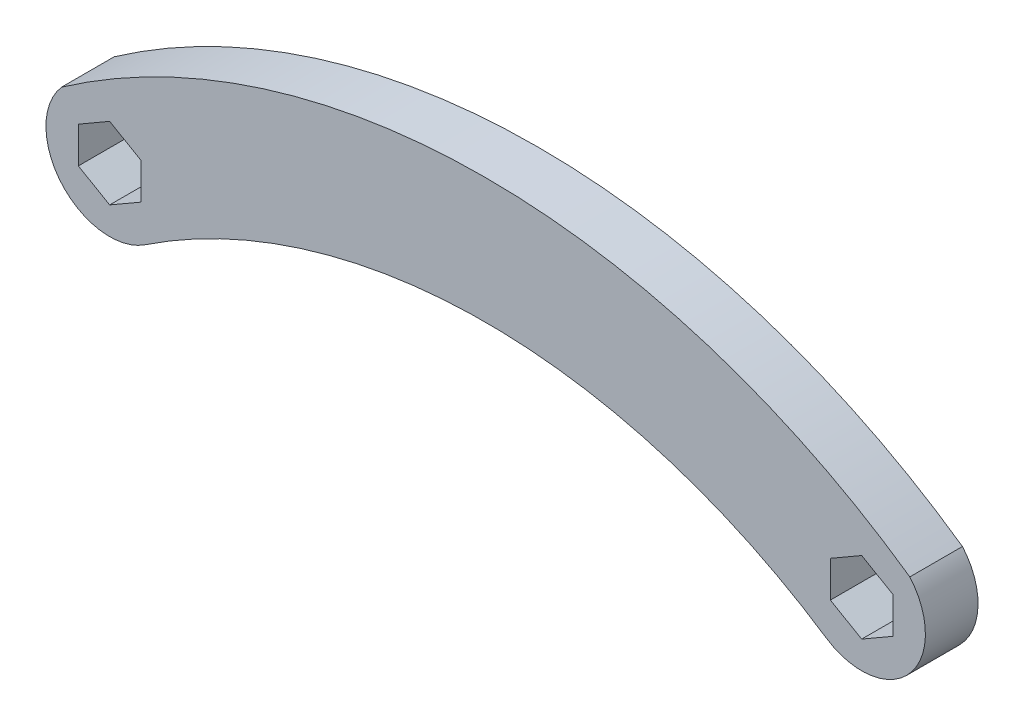
ISO-10303-21;
HEADER;
FILE_DESCRIPTION(('STEP AP214'),'2;1');
FILE_NAME('part.step','',(''),(''),'','','');
FILE_SCHEMA(('AUTOMOTIVE_DESIGN { 1 0 10303 214 1 1 1 1 }'));
ENDSEC;
DATA;
#1=APPLICATION_CONTEXT('core data for automotive mechanical design processes');
#2=APPLICATION_PROTOCOL_DEFINITION('international standard','automotive_design',2000,#1);
#3=PRODUCT_CONTEXT('',#1,'mechanical');
#4=PRODUCT('Part','Part','',(#3));
#5=PRODUCT_RELATED_PRODUCT_CATEGORY('part','',(#4));
#6=PRODUCT_DEFINITION_FORMATION('','',#4);
#7=PRODUCT_DEFINITION_CONTEXT('part definition',#1,'design');
#8=PRODUCT_DEFINITION('design','',#6,#7);
#9=PRODUCT_DEFINITION_SHAPE('','',#8);
#10=(LENGTH_UNIT() NAMED_UNIT(*) SI_UNIT(.MILLI.,.METRE.));
#11=(NAMED_UNIT(*) PLANE_ANGLE_UNIT() SI_UNIT($,.RADIAN.));
#12=(NAMED_UNIT(*) SI_UNIT($,.STERADIAN.) SOLID_ANGLE_UNIT());
#13=UNCERTAINTY_MEASURE_WITH_UNIT(LENGTH_MEASURE(1.E-05),#10,'distance_accuracy_value','');
#14=(GEOMETRIC_REPRESENTATION_CONTEXT(3) GLOBAL_UNCERTAINTY_ASSIGNED_CONTEXT((#13)) GLOBAL_UNIT_ASSIGNED_CONTEXT((#10,
#11,#12)) REPRESENTATION_CONTEXT('',''));
#15=CARTESIAN_POINT('',(0.,0.,0.));
#16=DIRECTION('',(0.,0.,1.));
#17=DIRECTION('',(1.,0.,0.));
#18=AXIS2_PLACEMENT_3D('',#15,#16,#17);
#19=CARTESIAN_POINT('',(-19.05,28.575,5.334));
#20=DIRECTION('',(0.,0.,1.));
#21=DIRECTION('',(1.,0.,0.));
#22=AXIS2_PLACEMENT_3D('',#19,#20,#21);
#23=PLANE('',#22);
#24=CARTESIAN_POINT('',(-38.1,57.15,5.334));
#25=DIRECTION('',(0.,0.,1.));
#26=DIRECTION('',(1.,0.,0.));
#27=AXIS2_PLACEMENT_3D('',#24,#25,#26);
#28=CIRCLE('',#27,6.45575179758904);
#29=CARTESIAN_POINT('',(-42.977057525789,61.3797802735153,5.334));
#30=VERTEX_POINT('',#29);
#31=CARTESIAN_POINT('',(-34.518993211096,51.778489816644,5.334));
#32=VERTEX_POINT('',#31);
#33=EDGE_CURVE('E241',#30,#32,#28,.T.);
#34=ORIENTED_EDGE('',*,*,#33,.T.);
#35=CARTESIAN_POINT('',(0.,0.,5.334));
#36=DIRECTION('',(0.,0.,-1.));
#37=DIRECTION('',(1.,0.,0.));
#38=AXIS2_PLACEMENT_3D('',#35,#36,#37);
#39=CIRCLE('',#38,62.23);
#40=CARTESIAN_POINT('',(34.518993211096,51.778489816644,5.334));
#41=VERTEX_POINT('',#40);
#42=EDGE_CURVE('E244',#32,#41,#39,.T.);
#43=ORIENTED_EDGE('',*,*,#42,.T.);
#44=CARTESIAN_POINT('',(38.1,57.15,5.334));
#45=DIRECTION('',(0.,0.,1.));
#46=DIRECTION('',(-1.,0.,0.));
#47=AXIS2_PLACEMENT_3D('',#44,#45,#46);
#48=CIRCLE('',#47,6.45575179758904);
#49=CARTESIAN_POINT('',(42.977057525789,61.3797802735153,5.334));
#50=VERTEX_POINT('',#49);
#51=EDGE_CURVE('E247',#41,#50,#48,.T.);
#52=ORIENTED_EDGE('',*,*,#51,.T.);
#53=CARTESIAN_POINT('',(0.,0.,5.334));
#54=DIRECTION('',(0.,0.,1.));
#55=DIRECTION('',(1.,0.,0.));
#56=AXIS2_PLACEMENT_3D('',#53,#54,#55);
#57=CIRCLE('',#56,74.93);
#58=EDGE_CURVE('E249',#50,#30,#57,.T.);
#59=ORIENTED_EDGE('',*,*,#58,.T.);
#60=EDGE_LOOP('',(#34,#43,#52,#59));
#61=FACE_BOUND('',#60,.T.);
#62=DIRECTION('',(-0.866025403784438,-0.500000000000001,0.));
#63=VECTOR('',#62,1.);
#64=CARTESIAN_POINT('',(-38.1,60.8161742093541,5.334));
#65=LINE('',#64,#63);
#66=CARTESIAN_POINT('',(-38.1,60.8161742093541,5.334));
#67=VERTEX_POINT('',#66);
#68=CARTESIAN_POINT('',(-41.275,58.9830871046771,5.334));
#69=VERTEX_POINT('',#68);
#70=EDGE_CURVE('E198',#67,#69,#65,.T.);
#71=ORIENTED_EDGE('',*,*,#70,.F.);
#72=DIRECTION('',(-0.866025403784438,0.500000000000001,0.));
#73=VECTOR('',#72,1.);
#74=CARTESIAN_POINT('',(-34.925,58.9830871046771,5.334));
#75=LINE('',#74,#73);
#76=CARTESIAN_POINT('',(-34.925,58.9830871046771,5.334));
#77=VERTEX_POINT('',#76);
#78=EDGE_CURVE('E196',#77,#67,#75,.T.);
#79=ORIENTED_EDGE('',*,*,#78,.F.);
#80=DIRECTION('',(0.,1.,0.));
#81=VECTOR('',#80,1.);
#82=CARTESIAN_POINT('',(-34.925,55.3169128953229,5.334));
#83=LINE('',#82,#81);
#84=CARTESIAN_POINT('',(-34.925,55.3169128953229,5.334));
#85=VERTEX_POINT('',#84);
#86=EDGE_CURVE('E208',#85,#77,#83,.T.);
#87=ORIENTED_EDGE('',*,*,#86,.F.);
#88=DIRECTION('',(0.866025403784438,0.500000000000001,0.));
#89=VECTOR('',#88,1.);
#90=CARTESIAN_POINT('',(-38.1,53.4838257906459,5.334));
#91=LINE('',#90,#89);
#92=CARTESIAN_POINT('',(-38.1,53.4838257906459,5.334));
#93=VERTEX_POINT('',#92);
#94=EDGE_CURVE('E205',#93,#85,#91,.T.);
#95=ORIENTED_EDGE('',*,*,#94,.F.);
#96=DIRECTION('',(0.866025403784438,-0.500000000000001,0.));
#97=VECTOR('',#96,1.);
#98=CARTESIAN_POINT('',(-41.275,55.3169128953229,5.334));
#99=LINE('',#98,#97);
#100=CARTESIAN_POINT('',(-41.275,55.3169128953229,5.334));
#101=VERTEX_POINT('',#100);
#102=EDGE_CURVE('E203',#101,#93,#99,.T.);
#103=ORIENTED_EDGE('',*,*,#102,.F.);
#104=DIRECTION('',(0.,-1.,0.));
#105=VECTOR('',#104,1.);
#106=CARTESIAN_POINT('',(-41.275,58.9830871046771,5.334));
#107=LINE('',#106,#105);
#108=EDGE_CURVE('E201',#69,#101,#107,.T.);
#109=ORIENTED_EDGE('',*,*,#108,.F.);
#110=EDGE_LOOP('',(#71,#79,#87,#95,#103,#109));
#111=FACE_BOUND('',#110,.T.);
#112=DIRECTION('',(-0.866025403784438,-0.5,0.));
#113=VECTOR('',#112,1.);
#114=CARTESIAN_POINT('',(38.1,60.8161742093541,5.334));
#115=LINE('',#114,#113);
#116=CARTESIAN_POINT('',(38.1,60.8161742093541,5.334));
#117=VERTEX_POINT('',#116);
#118=CARTESIAN_POINT('',(34.925,58.9830871046771,5.334));
#119=VERTEX_POINT('',#118);
#120=EDGE_CURVE('E153',#117,#119,#115,.T.);
#121=ORIENTED_EDGE('',*,*,#120,.F.);
#122=DIRECTION('',(-0.866025403784438,0.5,0.));
#123=VECTOR('',#122,1.);
#124=CARTESIAN_POINT('',(41.275,58.9830871046771,5.334));
#125=LINE('',#124,#123);
#126=CARTESIAN_POINT('',(41.275,58.9830871046771,5.334));
#127=VERTEX_POINT('',#126);
#128=EDGE_CURVE('E145',#127,#117,#125,.T.);
#129=ORIENTED_EDGE('',*,*,#128,.F.);
#130=DIRECTION('',(0.,1.,0.));
#131=VECTOR('',#130,1.);
#132=CARTESIAN_POINT('',(41.275,55.316912895323,5.334));
#133=LINE('',#132,#131);
#134=CARTESIAN_POINT('',(41.275,55.316912895323,5.334));
#135=VERTEX_POINT('',#134);
#136=EDGE_CURVE('E174',#135,#127,#133,.T.);
#137=ORIENTED_EDGE('',*,*,#136,.F.);
#138=DIRECTION('',(0.866025403784438,0.5,0.));
#139=VECTOR('',#138,1.);
#140=CARTESIAN_POINT('',(38.1,53.4838257906459,5.334));
#141=LINE('',#140,#139);
#142=CARTESIAN_POINT('',(38.1,53.4838257906459,5.334));
#143=VERTEX_POINT('',#142);
#144=EDGE_CURVE('E172',#143,#135,#141,.T.);
#145=ORIENTED_EDGE('',*,*,#144,.F.);
#146=DIRECTION('',(0.866025403784439,-0.499999999999999,0.));
#147=VECTOR('',#146,1.);
#148=CARTESIAN_POINT('',(34.925,55.3169128953229,5.334));
#149=LINE('',#148,#147);
#150=CARTESIAN_POINT('',(34.925,55.3169128953229,5.334));
#151=VERTEX_POINT('',#150);
#152=EDGE_CURVE('E168',#151,#143,#149,.T.);
#153=ORIENTED_EDGE('',*,*,#152,.F.);
#154=DIRECTION('',(0.,-1.,0.));
#155=VECTOR('',#154,1.);
#156=CARTESIAN_POINT('',(34.925,58.9830871046771,5.334));
#157=LINE('',#156,#155);
#158=EDGE_CURVE('E166',#119,#151,#157,.T.);
#159=ORIENTED_EDGE('',*,*,#158,.F.);
#160=EDGE_LOOP('',(#121,#129,#137,#145,#153,#159));
#161=FACE_BOUND('',#160,.T.);
#162=ADVANCED_FACE('F32',(#61,#111,#161),#23,.T.);
#163=CARTESIAN_POINT('',(-19.05,28.575,0.));
#164=DIRECTION('',(0.,0.,1.));
#165=DIRECTION('',(1.,0.,0.));
#166=AXIS2_PLACEMENT_3D('',#163,#164,#165);
#167=PLANE('',#166);
#168=DIRECTION('',(-0.866025403784438,0.500000000000001,0.));
#169=VECTOR('',#168,1.);
#170=CARTESIAN_POINT('',(-34.925,58.9830871046771,0.));
#171=LINE('',#170,#169);
#172=CARTESIAN_POINT('',(-34.925,58.9830871046771,0.));
#173=VERTEX_POINT('',#172);
#174=CARTESIAN_POINT('',(-38.1,60.8161742093541,0.));
#175=VERTEX_POINT('',#174);
#176=EDGE_CURVE('E161',#173,#175,#171,.T.);
#177=ORIENTED_EDGE('',*,*,#176,.T.);
#178=DIRECTION('',(-0.866025403784438,-0.500000000000001,0.));
#179=VECTOR('',#178,1.);
#180=CARTESIAN_POINT('',(-38.1,60.8161742093541,0.));
#181=LINE('',#180,#179);
#182=CARTESIAN_POINT('',(-41.275,58.9830871046771,0.));
#183=VERTEX_POINT('',#182);
#184=EDGE_CURVE('E213',#175,#183,#181,.T.);
#185=ORIENTED_EDGE('',*,*,#184,.T.);
#186=DIRECTION('',(0.,-1.,0.));
#187=VECTOR('',#186,1.);
#188=CARTESIAN_POINT('',(-41.275,58.9830871046771,0.));
#189=LINE('',#188,#187);
#190=CARTESIAN_POINT('',(-41.275,55.3169128953229,0.));
#191=VERTEX_POINT('',#190);
#192=EDGE_CURVE('E216',#183,#191,#189,.T.);
#193=ORIENTED_EDGE('',*,*,#192,.T.);
#194=DIRECTION('',(0.866025403784438,-0.500000000000001,0.));
#195=VECTOR('',#194,1.);
#196=CARTESIAN_POINT('',(-41.275,55.3169128953229,0.));
#197=LINE('',#196,#195);
#198=CARTESIAN_POINT('',(-38.1,53.4838257906459,0.));
#199=VERTEX_POINT('',#198);
#200=EDGE_CURVE('E219',#191,#199,#197,.T.);
#201=ORIENTED_EDGE('',*,*,#200,.T.);
#202=DIRECTION('',(0.866025403784438,0.500000000000001,0.));
#203=VECTOR('',#202,1.);
#204=CARTESIAN_POINT('',(-38.1,53.4838257906459,0.));
#205=LINE('',#204,#203);
#206=CARTESIAN_POINT('',(-34.925,55.3169128953229,0.));
#207=VERTEX_POINT('',#206);
#208=EDGE_CURVE('E222',#199,#207,#205,.T.);
#209=ORIENTED_EDGE('',*,*,#208,.T.);
#210=DIRECTION('',(0.,1.,0.));
#211=VECTOR('',#210,1.);
#212=CARTESIAN_POINT('',(-34.925,55.3169128953229,0.));
#213=LINE('',#212,#211);
#214=EDGE_CURVE('E199',#207,#173,#213,.T.);
#215=ORIENTED_EDGE('',*,*,#214,.T.);
#216=EDGE_LOOP('',(#177,#185,#193,#201,#209,#215));
#217=FACE_BOUND('',#216,.T.);
#218=CARTESIAN_POINT('',(-38.1,57.15,0.));
#219=DIRECTION('',(0.,0.,1.));
#220=DIRECTION('',(1.,0.,0.));
#221=AXIS2_PLACEMENT_3D('',#218,#219,#220);
#222=CIRCLE('',#221,6.45575179758904);
#223=CARTESIAN_POINT('',(-42.977057525789,61.3797802735153,0.));
#224=VERTEX_POINT('',#223);
#225=CARTESIAN_POINT('',(-34.518993211096,51.778489816644,0.));
#226=VERTEX_POINT('',#225);
#227=EDGE_CURVE('E240',#224,#226,#222,.T.);
#228=ORIENTED_EDGE('',*,*,#227,.F.);
#229=CARTESIAN_POINT('',(0.,0.,0.));
#230=DIRECTION('',(0.,0.,1.));
#231=DIRECTION('',(1.,0.,0.));
#232=AXIS2_PLACEMENT_3D('',#229,#230,#231);
#233=CIRCLE('',#232,74.93);
#234=CARTESIAN_POINT('',(42.977057525789,61.3797802735153,0.));
#235=VERTEX_POINT('',#234);
#236=EDGE_CURVE('E245',#235,#224,#233,.T.);
#237=ORIENTED_EDGE('',*,*,#236,.F.);
#238=CARTESIAN_POINT('',(38.1,57.15,0.));
#239=DIRECTION('',(0.,0.,1.));
#240=DIRECTION('',(-1.,0.,0.));
#241=AXIS2_PLACEMENT_3D('',#238,#239,#240);
#242=CIRCLE('',#241,6.45575179758904);
#243=CARTESIAN_POINT('',(34.518993211096,51.778489816644,0.));
#244=VERTEX_POINT('',#243);
#245=EDGE_CURVE('E256',#244,#235,#242,.T.);
#246=ORIENTED_EDGE('',*,*,#245,.F.);
#247=CARTESIAN_POINT('',(0.,0.,0.));
#248=DIRECTION('',(0.,0.,-1.));
#249=DIRECTION('',(1.,0.,0.));
#250=AXIS2_PLACEMENT_3D('',#247,#248,#249);
#251=CIRCLE('',#250,62.23);
#252=EDGE_CURVE('E254',#226,#244,#251,.T.);
#253=ORIENTED_EDGE('',*,*,#252,.F.);
#254=EDGE_LOOP('',(#228,#237,#246,#253));
#255=FACE_BOUND('',#254,.T.);
#256=DIRECTION('',(-0.866025403784438,0.5,0.));
#257=VECTOR('',#256,1.);
#258=CARTESIAN_POINT('',(41.275,58.9830871046771,0.));
#259=LINE('',#258,#257);
#260=CARTESIAN_POINT('',(41.275,58.9830871046771,0.));
#261=VERTEX_POINT('',#260);
#262=CARTESIAN_POINT('',(38.1,60.8161742093541,0.));
#263=VERTEX_POINT('',#262);
#264=EDGE_CURVE('E55',#261,#263,#259,.T.);
#265=ORIENTED_EDGE('',*,*,#264,.T.);
#266=DIRECTION('',(-0.866025403784438,-0.5,0.));
#267=VECTOR('',#266,1.);
#268=CARTESIAN_POINT('',(38.1,60.8161742093541,0.));
#269=LINE('',#268,#267);
#270=CARTESIAN_POINT('',(34.925,58.9830871046771,0.));
#271=VERTEX_POINT('',#270);
#272=EDGE_CURVE('E160',#263,#271,#269,.T.);
#273=ORIENTED_EDGE('',*,*,#272,.T.);
#274=DIRECTION('',(0.,-1.,0.));
#275=VECTOR('',#274,1.);
#276=CARTESIAN_POINT('',(34.925,58.9830871046771,0.));
#277=LINE('',#276,#275);
#278=CARTESIAN_POINT('',(34.925,55.3169128953229,0.));
#279=VERTEX_POINT('',#278);
#280=EDGE_CURVE('E178',#271,#279,#277,.T.);
#281=ORIENTED_EDGE('',*,*,#280,.T.);
#282=DIRECTION('',(0.866025403784439,-0.499999999999999,0.));
#283=VECTOR('',#282,1.);
#284=CARTESIAN_POINT('',(34.925,55.3169128953229,0.));
#285=LINE('',#284,#283);
#286=CARTESIAN_POINT('',(38.1,53.4838257906459,0.));
#287=VERTEX_POINT('',#286);
#288=EDGE_CURVE('E181',#279,#287,#285,.T.);
#289=ORIENTED_EDGE('',*,*,#288,.T.);
#290=DIRECTION('',(0.866025403784438,0.5,0.));
#291=VECTOR('',#290,1.);
#292=CARTESIAN_POINT('',(38.1,53.4838257906459,0.));
#293=LINE('',#292,#291);
#294=CARTESIAN_POINT('',(41.275,55.316912895323,0.));
#295=VERTEX_POINT('',#294);
#296=EDGE_CURVE('E184',#287,#295,#293,.T.);
#297=ORIENTED_EDGE('',*,*,#296,.T.);
#298=DIRECTION('',(0.,1.,0.));
#299=VECTOR('',#298,1.);
#300=CARTESIAN_POINT('',(41.275,55.316912895323,0.));
#301=LINE('',#300,#299);
#302=EDGE_CURVE('E154',#295,#261,#301,.T.);
#303=ORIENTED_EDGE('',*,*,#302,.T.);
#304=EDGE_LOOP('',(#265,#273,#281,#289,#297,#303));
#305=FACE_BOUND('',#304,.T.);
#306=ADVANCED_FACE('F274',(#217,#255,#305),#167,.F.);
#307=CARTESIAN_POINT('',(-38.1,57.15,5.334));
#308=DIRECTION('',(0.,0.,-1.));
#309=DIRECTION('',(-1.,0.,0.));
#310=AXIS2_PLACEMENT_3D('',#307,#308,#309);
#311=CYLINDRICAL_SURFACE('',#310,6.45575179758904);
#312=ORIENTED_EDGE('',*,*,#227,.T.);
#313=DIRECTION('',(0.,0.,-1.));
#314=VECTOR('',#313,1.);
#315=CARTESIAN_POINT('',(-34.518993211096,51.778489816644,5.334));
#316=LINE('',#315,#314);
#317=EDGE_CURVE('E11',#32,#226,#316,.T.);
#318=ORIENTED_EDGE('',*,*,#317,.F.);
#319=ORIENTED_EDGE('',*,*,#33,.F.);
#320=DIRECTION('',(0.,0.,-1.));
#321=VECTOR('',#320,1.);
#322=CARTESIAN_POINT('',(-42.977057525789,61.3797802735153,5.334));
#323=LINE('',#322,#321);
#324=EDGE_CURVE('E251',#30,#224,#323,.T.);
#325=ORIENTED_EDGE('',*,*,#324,.T.);
#326=EDGE_LOOP('',(#312,#318,#319,#325));
#327=FACE_BOUND('',#326,.T.);
#328=ADVANCED_FACE('F34',(#327),#311,.T.);
#329=CARTESIAN_POINT('',(0.,0.,5.334));
#330=DIRECTION('',(0.,0.,-1.));
#331=DIRECTION('',(-1.,0.,0.));
#332=AXIS2_PLACEMENT_3D('',#329,#330,#331);
#333=CYLINDRICAL_SURFACE('',#332,62.23);
#334=ORIENTED_EDGE('',*,*,#252,.T.);
#335=DIRECTION('',(0.,0.,-1.));
#336=VECTOR('',#335,1.);
#337=CARTESIAN_POINT('',(34.518993211096,51.778489816644,5.334));
#338=LINE('',#337,#336);
#339=EDGE_CURVE('E40',#41,#244,#338,.T.);
#340=ORIENTED_EDGE('',*,*,#339,.F.);
#341=ORIENTED_EDGE('',*,*,#42,.F.);
#342=ORIENTED_EDGE('',*,*,#317,.T.);
#343=EDGE_LOOP('',(#334,#340,#341,#342));
#344=FACE_BOUND('',#343,.T.);
#345=ADVANCED_FACE('F285',(#344),#333,.F.);
#346=CARTESIAN_POINT('',(38.1,57.15,5.334));
#347=DIRECTION('',(0.,0.,-1.));
#348=DIRECTION('',(-1.,0.,0.));
#349=AXIS2_PLACEMENT_3D('',#346,#347,#348);
#350=CYLINDRICAL_SURFACE('',#349,6.45575179758904);
#351=ORIENTED_EDGE('',*,*,#245,.T.);
#352=DIRECTION('',(0.,0.,-1.));
#353=VECTOR('',#352,1.);
#354=CARTESIAN_POINT('',(42.977057525789,61.3797802735153,5.334));
#355=LINE('',#354,#353);
#356=EDGE_CURVE('E261',#50,#235,#355,.T.);
#357=ORIENTED_EDGE('',*,*,#356,.F.);
#358=ORIENTED_EDGE('',*,*,#51,.F.);
#359=ORIENTED_EDGE('',*,*,#339,.T.);
#360=EDGE_LOOP('',(#351,#357,#358,#359));
#361=FACE_BOUND('',#360,.T.);
#362=ADVANCED_FACE('F268',(#361),#350,.T.);
#363=CARTESIAN_POINT('',(0.,0.,5.334));
#364=DIRECTION('',(0.,0.,-1.));
#365=DIRECTION('',(-1.,0.,0.));
#366=AXIS2_PLACEMENT_3D('',#363,#364,#365);
#367=CYLINDRICAL_SURFACE('',#366,74.93);
#368=ORIENTED_EDGE('',*,*,#236,.T.);
#369=ORIENTED_EDGE('',*,*,#324,.F.);
#370=ORIENTED_EDGE('',*,*,#58,.F.);
#371=ORIENTED_EDGE('',*,*,#356,.T.);
#372=EDGE_LOOP('',(#368,#369,#370,#371));
#373=FACE_BOUND('',#372,.T.);
#374=ADVANCED_FACE('F278',(#373),#367,.T.);
#375=CARTESIAN_POINT('',(-34.925,58.9830871046771,5.334));
#376=DIRECTION('',(-0.500000000000001,-0.866025403784438,0.));
#377=DIRECTION('',(0.866025403784438,-0.500000000000001,0.));
#378=AXIS2_PLACEMENT_3D('',#375,#376,#377);
#379=PLANE('',#378);
#380=ORIENTED_EDGE('',*,*,#176,.F.);
#381=DIRECTION('',(0.,0.,-1.));
#382=VECTOR('',#381,1.);
#383=CARTESIAN_POINT('',(-34.925,58.9830871046771,5.334));
#384=LINE('',#383,#382);
#385=EDGE_CURVE('E210',#77,#173,#384,.T.);
#386=ORIENTED_EDGE('',*,*,#385,.F.);
#387=ORIENTED_EDGE('',*,*,#78,.T.);
#388=DIRECTION('',(0.,0.,-1.));
#389=VECTOR('',#388,1.);
#390=CARTESIAN_POINT('',(-38.1,60.8161742093541,5.334));
#391=LINE('',#390,#389);
#392=EDGE_CURVE('E237',#67,#175,#391,.T.);
#393=ORIENTED_EDGE('',*,*,#392,.T.);
#394=EDGE_LOOP('',(#380,#386,#387,#393));
#395=FACE_BOUND('',#394,.T.);
#396=ADVANCED_FACE('F300',(#395),#379,.T.);
#397=CARTESIAN_POINT('',(-38.1,60.8161742093541,5.334));
#398=DIRECTION('',(0.500000000000001,-0.866025403784438,0.));
#399=DIRECTION('',(0.866025403784438,0.500000000000001,0.));
#400=AXIS2_PLACEMENT_3D('',#397,#398,#399);
#401=PLANE('',#400);
#402=ORIENTED_EDGE('',*,*,#184,.F.);
#403=ORIENTED_EDGE('',*,*,#392,.F.);
#404=ORIENTED_EDGE('',*,*,#70,.T.);
#405=DIRECTION('',(0.,0.,-1.));
#406=VECTOR('',#405,1.);
#407=CARTESIAN_POINT('',(-41.275,58.9830871046771,5.334));
#408=LINE('',#407,#406);
#409=EDGE_CURVE('E235',#69,#183,#408,.T.);
#410=ORIENTED_EDGE('',*,*,#409,.T.);
#411=EDGE_LOOP('',(#402,#403,#404,#410));
#412=FACE_BOUND('',#411,.T.);
#413=ADVANCED_FACE('F307',(#412),#401,.T.);
#414=CARTESIAN_POINT('',(-41.275,58.9830871046771,5.334));
#415=DIRECTION('',(1.,0.,0.));
#416=DIRECTION('',(0.,0.,-1.));
#417=AXIS2_PLACEMENT_3D('',#414,#415,#416);
#418=PLANE('',#417);
#419=ORIENTED_EDGE('',*,*,#192,.F.);
#420=ORIENTED_EDGE('',*,*,#409,.F.);
#421=ORIENTED_EDGE('',*,*,#108,.T.);
#422=DIRECTION('',(0.,0.,-1.));
#423=VECTOR('',#422,1.);
#424=CARTESIAN_POINT('',(-41.275,55.3169128953229,5.334));
#425=LINE('',#424,#423);
#426=EDGE_CURVE('E233',#101,#191,#425,.T.);
#427=ORIENTED_EDGE('',*,*,#426,.T.);
#428=EDGE_LOOP('',(#419,#420,#421,#427));
#429=FACE_BOUND('',#428,.T.);
#430=ADVANCED_FACE('F312',(#429),#418,.T.);
#431=CARTESIAN_POINT('',(-41.275,55.3169128953229,5.334));
#432=DIRECTION('',(0.500000000000001,0.866025403784438,0.));
#433=DIRECTION('',(-0.866025403784438,0.500000000000001,0.));
#434=AXIS2_PLACEMENT_3D('',#431,#432,#433);
#435=PLANE('',#434);
#436=ORIENTED_EDGE('',*,*,#200,.F.);
#437=ORIENTED_EDGE('',*,*,#426,.F.);
#438=ORIENTED_EDGE('',*,*,#102,.T.);
#439=DIRECTION('',(0.,0.,-1.));
#440=VECTOR('',#439,1.);
#441=CARTESIAN_POINT('',(-38.1,53.4838257906459,5.334));
#442=LINE('',#441,#440);
#443=EDGE_CURVE('E231',#93,#199,#442,.T.);
#444=ORIENTED_EDGE('',*,*,#443,.T.);
#445=EDGE_LOOP('',(#436,#437,#438,#444));
#446=FACE_BOUND('',#445,.T.);
#447=ADVANCED_FACE('F335',(#446),#435,.T.);
#448=CARTESIAN_POINT('',(-38.1,53.4838257906459,5.334));
#449=DIRECTION('',(-0.500000000000001,0.866025403784438,0.));
#450=DIRECTION('',(-0.866025403784438,-0.500000000000001,0.));
#451=AXIS2_PLACEMENT_3D('',#448,#449,#450);
#452=PLANE('',#451);
#453=ORIENTED_EDGE('',*,*,#208,.F.);
#454=ORIENTED_EDGE('',*,*,#443,.F.);
#455=ORIENTED_EDGE('',*,*,#94,.T.);
#456=DIRECTION('',(0.,0.,-1.));
#457=VECTOR('',#456,1.);
#458=CARTESIAN_POINT('',(-34.925,55.3169128953229,5.334));
#459=LINE('',#458,#457);
#460=EDGE_CURVE('E229',#85,#207,#459,.T.);
#461=ORIENTED_EDGE('',*,*,#460,.T.);
#462=EDGE_LOOP('',(#453,#454,#455,#461));
#463=FACE_BOUND('',#462,.T.);
#464=ADVANCED_FACE('F325',(#463),#452,.T.);
#465=CARTESIAN_POINT('',(-34.925,55.3169128953229,5.334));
#466=DIRECTION('',(-1.,0.,0.));
#467=DIRECTION('',(0.,0.,1.));
#468=AXIS2_PLACEMENT_3D('',#465,#466,#467);
#469=PLANE('',#468);
#470=ORIENTED_EDGE('',*,*,#214,.F.);
#471=ORIENTED_EDGE('',*,*,#460,.F.);
#472=ORIENTED_EDGE('',*,*,#86,.T.);
#473=ORIENTED_EDGE('',*,*,#385,.T.);
#474=EDGE_LOOP('',(#470,#471,#472,#473));
#475=FACE_BOUND('',#474,.T.);
#476=ADVANCED_FACE('F319',(#475),#469,.T.);
#477=CARTESIAN_POINT('',(41.275,58.9830871046771,5.334));
#478=DIRECTION('',(-0.5,-0.866025403784438,0.));
#479=DIRECTION('',(0.866025403784439,-0.5,0.));
#480=AXIS2_PLACEMENT_3D('',#477,#478,#479);
#481=PLANE('',#480);
#482=ORIENTED_EDGE('',*,*,#264,.F.);
#483=DIRECTION('',(0.,0.,-1.));
#484=VECTOR('',#483,1.);
#485=CARTESIAN_POINT('',(41.275,58.9830871046771,5.334));
#486=LINE('',#485,#484);
#487=EDGE_CURVE('E149',#127,#261,#486,.T.);
#488=ORIENTED_EDGE('',*,*,#487,.F.);
#489=ORIENTED_EDGE('',*,*,#128,.T.);
#490=DIRECTION('',(0.,0.,-1.));
#491=VECTOR('',#490,1.);
#492=CARTESIAN_POINT('',(38.1,60.8161742093541,5.334));
#493=LINE('',#492,#491);
#494=EDGE_CURVE('E148',#117,#263,#493,.T.);
#495=ORIENTED_EDGE('',*,*,#494,.T.);
#496=EDGE_LOOP('',(#482,#488,#489,#495));
#497=FACE_BOUND('',#496,.T.);
#498=ADVANCED_FACE('F147',(#497),#481,.T.);
#499=CARTESIAN_POINT('',(38.1,60.8161742093541,5.334));
#500=DIRECTION('',(0.5,-0.866025403784438,0.));
#501=DIRECTION('',(0.866025403784439,0.5,0.));
#502=AXIS2_PLACEMENT_3D('',#499,#500,#501);
#503=PLANE('',#502);
#504=ORIENTED_EDGE('',*,*,#272,.F.);
#505=ORIENTED_EDGE('',*,*,#494,.F.);
#506=ORIENTED_EDGE('',*,*,#120,.T.);
#507=DIRECTION('',(0.,0.,-1.));
#508=VECTOR('',#507,1.);
#509=CARTESIAN_POINT('',(34.925,58.9830871046771,5.334));
#510=LINE('',#509,#508);
#511=EDGE_CURVE('E162',#119,#271,#510,.T.);
#512=ORIENTED_EDGE('',*,*,#511,.T.);
#513=EDGE_LOOP('',(#504,#505,#506,#512));
#514=FACE_BOUND('',#513,.T.);
#515=ADVANCED_FACE('F157',(#514),#503,.T.);
#516=CARTESIAN_POINT('',(34.925,58.9830871046771,5.334));
#517=DIRECTION('',(1.,0.,0.));
#518=DIRECTION('',(0.,0.,-1.));
#519=AXIS2_PLACEMENT_3D('',#516,#517,#518);
#520=PLANE('',#519);
#521=ORIENTED_EDGE('',*,*,#280,.F.);
#522=ORIENTED_EDGE('',*,*,#511,.F.);
#523=ORIENTED_EDGE('',*,*,#158,.T.);
#524=DIRECTION('',(0.,0.,-1.));
#525=VECTOR('',#524,1.);
#526=CARTESIAN_POINT('',(34.925,55.3169128953229,5.334));
#527=LINE('',#526,#525);
#528=EDGE_CURVE('E193',#151,#279,#527,.T.);
#529=ORIENTED_EDGE('',*,*,#528,.T.);
#530=EDGE_LOOP('',(#521,#522,#523,#529));
#531=FACE_BOUND('',#530,.T.);
#532=ADVANCED_FACE('F351',(#531),#520,.T.);
#533=CARTESIAN_POINT('',(34.925,55.3169128953229,5.334));
#534=DIRECTION('',(0.499999999999999,0.866025403784439,0.));
#535=DIRECTION('',(-0.866025403784439,0.499999999999999,0.));
#536=AXIS2_PLACEMENT_3D('',#533,#534,#535);
#537=PLANE('',#536);
#538=ORIENTED_EDGE('',*,*,#288,.F.);
#539=ORIENTED_EDGE('',*,*,#528,.F.);
#540=ORIENTED_EDGE('',*,*,#152,.T.);
#541=DIRECTION('',(0.,0.,-1.));
#542=VECTOR('',#541,1.);
#543=CARTESIAN_POINT('',(38.1,53.4838257906459,5.334));
#544=LINE('',#543,#542);
#545=EDGE_CURVE('E191',#143,#287,#544,.T.);
#546=ORIENTED_EDGE('',*,*,#545,.T.);
#547=EDGE_LOOP('',(#538,#539,#540,#546));
#548=FACE_BOUND('',#547,.T.);
#549=ADVANCED_FACE('F354',(#548),#537,.T.);
#550=CARTESIAN_POINT('',(38.1,53.4838257906459,5.334));
#551=DIRECTION('',(-0.5,0.866025403784438,0.));
#552=DIRECTION('',(-0.866025403784439,-0.5,0.));
#553=AXIS2_PLACEMENT_3D('',#550,#551,#552);
#554=PLANE('',#553);
#555=ORIENTED_EDGE('',*,*,#296,.F.);
#556=ORIENTED_EDGE('',*,*,#545,.F.);
#557=ORIENTED_EDGE('',*,*,#144,.T.);
#558=DIRECTION('',(0.,0.,-1.));
#559=VECTOR('',#558,1.);
#560=CARTESIAN_POINT('',(41.275,55.316912895323,5.334));
#561=LINE('',#560,#559);
#562=EDGE_CURVE('E47',#135,#295,#561,.T.);
#563=ORIENTED_EDGE('',*,*,#562,.T.);
#564=EDGE_LOOP('',(#555,#556,#557,#563));
#565=FACE_BOUND('',#564,.T.);
#566=ADVANCED_FACE('F358',(#565),#554,.T.);
#567=CARTESIAN_POINT('',(41.275,55.316912895323,5.334));
#568=DIRECTION('',(-1.,0.,0.));
#569=DIRECTION('',(0.,0.,1.));
#570=AXIS2_PLACEMENT_3D('',#567,#568,#569);
#571=PLANE('',#570);
#572=ORIENTED_EDGE('',*,*,#302,.F.);
#573=ORIENTED_EDGE('',*,*,#562,.F.);
#574=ORIENTED_EDGE('',*,*,#136,.T.);
#575=ORIENTED_EDGE('',*,*,#487,.T.);
#576=EDGE_LOOP('',(#572,#573,#574,#575));
#577=FACE_BOUND('',#576,.T.);
#578=ADVANCED_FACE('F362',(#577),#571,.T.);
#579=CLOSED_SHELL('',(#162,#306,#328,#345,#362,#374,#396,#413,#430,#447,#464,#476,#498,#515,
#532,#549,#566,#578));
#580=MANIFOLD_SOLID_BREP('B2',#579);
#581=ADVANCED_BREP_SHAPE_REPRESENTATION('',(#18,#580),#14);
#582=SHAPE_DEFINITION_REPRESENTATION(#9,#581);
ENDSEC;
END-ISO-10303-21;
